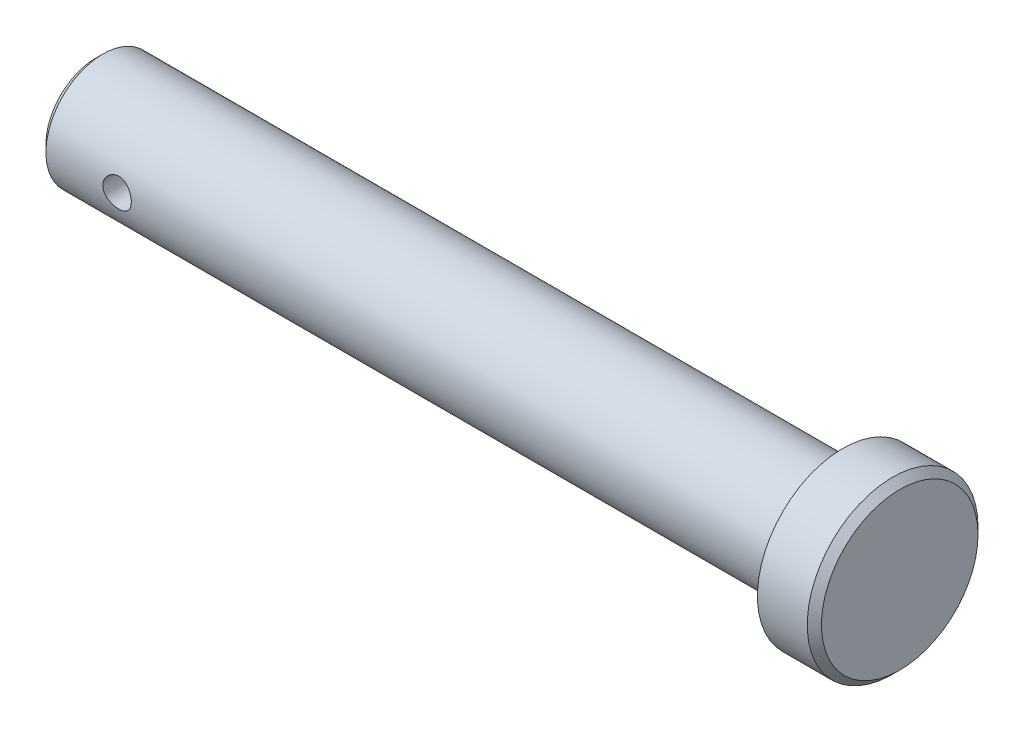
ISO-10303-21;
HEADER;
FILE_DESCRIPTION(('STEP AP214'),'2;1');
FILE_NAME('part.step','',(''),(''),'','','');
FILE_SCHEMA(('AUTOMOTIVE_DESIGN { 1 0 10303 214 1 1 1 1 }'));
ENDSEC;
DATA;
#1=APPLICATION_CONTEXT('core data for automotive mechanical design processes');
#2=APPLICATION_PROTOCOL_DEFINITION('international standard','automotive_design',2000,#1);
#3=PRODUCT_CONTEXT('',#1,'mechanical');
#4=PRODUCT('Part','Part','',(#3));
#5=PRODUCT_RELATED_PRODUCT_CATEGORY('part','',(#4));
#6=PRODUCT_DEFINITION_FORMATION('','',#4);
#7=PRODUCT_DEFINITION_CONTEXT('part definition',#1,'design');
#8=PRODUCT_DEFINITION('design','',#6,#7);
#9=PRODUCT_DEFINITION_SHAPE('','',#8);
#10=(LENGTH_UNIT() NAMED_UNIT(*) SI_UNIT(.MILLI.,.METRE.));
#11=(NAMED_UNIT(*) PLANE_ANGLE_UNIT() SI_UNIT($,.RADIAN.));
#12=(NAMED_UNIT(*) SI_UNIT($,.STERADIAN.) SOLID_ANGLE_UNIT());
#13=UNCERTAINTY_MEASURE_WITH_UNIT(LENGTH_MEASURE(1.E-05),#10,'distance_accuracy_value','');
#14=(GEOMETRIC_REPRESENTATION_CONTEXT(3) GLOBAL_UNCERTAINTY_ASSIGNED_CONTEXT((#13)) GLOBAL_UNIT_ASSIGNED_CONTEXT((#10,
#11,#12)) REPRESENTATION_CONTEXT('',''));
#15=CARTESIAN_POINT('',(0.,0.,0.));
#16=DIRECTION('',(0.,0.,1.));
#17=DIRECTION('',(1.,0.,0.));
#18=AXIS2_PLACEMENT_3D('',#15,#16,#17);
#19=CARTESIAN_POINT('',(-105.,0.,0.));
#20=DIRECTION('',(1.,0.,0.));
#21=DIRECTION('',(0.,0.,-1.));
#22=AXIS2_PLACEMENT_3D('',#19,#20,#21);
#23=CYLINDRICAL_SURFACE('',#22,8.);
#24=CARTESIAN_POINT('',(-96.,0.,8.));
#25=CARTESIAN_POINT('',(-95.9999968990158,0.110501451559641,7.9999981315735));
#26=CARTESIAN_POINT('',(-95.990811265635,0.22103754377435,7.99768770842435));
#27=CARTESIAN_POINT('',(-95.954366464924,0.438941765027376,7.98869485106526));
#28=CARTESIAN_POINT('',(-95.9270970539495,0.546308062494318,7.98200993893301));
#29=CARTESIAN_POINT('',(-95.8554143287172,0.754694496243434,7.96500835109376));
#30=CARTESIAN_POINT('',(-95.811021601713,0.855722084573335,7.95469603789411));
#31=CARTESIAN_POINT('',(-95.7064248132735,1.04889617587257,7.93153791743495));
#32=CARTESIAN_POINT('',(-95.646220218508,1.14104237913168,7.91869202472208));
#33=CARTESIAN_POINT('',(-95.5103989471278,1.31573590306788,7.89156551455591));
#34=CARTESIAN_POINT('',(-95.4345179000546,1.39807425341474,7.87726276197502));
#35=CARTESIAN_POINT('',(-95.270063726788,1.54899856960442,7.84898160157249));
#36=CARTESIAN_POINT('',(-95.1814891694041,1.61758298259892,7.83500323053157));
#37=CARTESIAN_POINT('',(-94.992539697684,1.74003539039863,7.80873034264225));
#38=CARTESIAN_POINT('',(-94.8920090255884,1.79366962123351,7.79646392619748));
#39=CARTESIAN_POINT('',(-94.6830021177866,1.88319587806765,7.77532659757355));
#40=CARTESIAN_POINT('',(-94.5745271555573,1.91909074058685,7.76645514259225));
#41=CARTESIAN_POINT('',(-94.3550086690644,1.97140644907302,7.7533396892843));
#42=CARTESIAN_POINT('',(-94.244060138616,1.98820302444273,7.74900654662681));
#43=CARTESIAN_POINT('',(-94.0208419080009,2.00301570008854,7.74519149946122));
#44=CARTESIAN_POINT('',(-93.9085724257438,2.00103485575748,7.74570880570571));
#45=CARTESIAN_POINT('',(-93.6887789230062,1.9786486995196,7.75145607355756));
#46=CARTESIAN_POINT('',(-93.5812058380462,1.95869112025417,7.75657150676392));
#47=CARTESIAN_POINT('',(-93.3709852654519,1.90163224920398,7.77075612894759));
#48=CARTESIAN_POINT('',(-93.2683381292948,1.86452973609252,7.77982559958985));
#49=CARTESIAN_POINT('',(-93.0696826449972,1.77385263724957,7.80100151874212));
#50=CARTESIAN_POINT('',(-92.9737517709472,1.72011555631055,7.81313769959755));
#51=CARTESIAN_POINT('',(-92.7921083869909,1.59780836801992,7.83906281127988));
#52=CARTESIAN_POINT('',(-92.7063976692437,1.52923566507844,7.85285203112837));
#53=CARTESIAN_POINT('',(-92.5450618457408,1.37688456624162,7.88101174053189));
#54=CARTESIAN_POINT('',(-92.4697940132515,1.29272834422114,7.89538759304001));
#55=CARTESIAN_POINT('',(-92.3343716767148,1.11281589000493,7.92274620771675));
#56=CARTESIAN_POINT('',(-92.2742176343152,1.01705930361059,7.93572892732543));
#57=CARTESIAN_POINT('',(-92.1705992183675,0.816154518241855,7.95890309458921));
#58=CARTESIAN_POINT('',(-92.1271928796608,0.710975190944831,7.96908480170303));
#59=CARTESIAN_POINT('',(-92.0587769257206,0.494501344190513,7.98543889321888));
#60=CARTESIAN_POINT('',(-92.0337637914425,0.383207998867318,7.99161204452374));
#61=CARTESIAN_POINT('',(-92.0033899125882,0.160719960520042,7.999139990285));
#62=CARTESIAN_POINT('',(-91.9975426318996,0.049595626650952,8.00061404677705));
#63=CARTESIAN_POINT('',(-92.0043320027407,-0.172043833068673,7.99891739752601));
#64=CARTESIAN_POINT('',(-92.0169669903989,-0.282559012859456,7.99574710989128));
#65=CARTESIAN_POINT('',(-92.0599612111885,-0.498152358368652,7.98519441503143));
#66=CARTESIAN_POINT('',(-92.0900550179693,-0.603286825291669,7.97787512247748));
#67=CARTESIAN_POINT('',(-92.1668094453713,-0.807009723270011,7.95984942178845));
#68=CARTESIAN_POINT('',(-92.2134717390842,-0.905597492043508,7.94914267159856));
#69=CARTESIAN_POINT('',(-92.3229815051663,-1.09536417923979,7.92524410568414));
#70=CARTESIAN_POINT('',(-92.3861014831957,-1.18638058911443,7.91201156489243));
#71=CARTESIAN_POINT('',(-92.5263865450626,-1.35670215152432,7.88459345583226));
#72=CARTESIAN_POINT('',(-92.6035540528225,-1.43600527863067,7.87040772335606));
#73=CARTESIAN_POINT('',(-92.7720026144593,-1.58265409076364,7.84225275947695));
#74=CARTESIAN_POINT('',(-92.8635836040032,-1.6496584901627,7.82829738916375));
#75=CARTESIAN_POINT('',(-93.0569768459543,-1.76734767868359,7.80257171169652));
#76=CARTESIAN_POINT('',(-93.1587886439463,-1.81803319221058,7.79080130756035));
#77=CARTESIAN_POINT('',(-93.3692076298841,-1.90126856081239,7.77090792979553));
#78=CARTESIAN_POINT('',(-93.4777701711254,-1.93392586220542,7.76276340389208));
#79=CARTESIAN_POINT('',(-93.6990795171855,-1.98046087993837,7.75102325453578));
#80=CARTESIAN_POINT('',(-93.8118254013767,-1.99434270330487,7.74742663626582));
#81=CARTESIAN_POINT('',(-94.0348280318069,-2.00271812044532,7.74526534938609));
#82=CARTESIAN_POINT('',(-94.145063246833,-1.99775719704016,7.74655910304351));
#83=CARTESIAN_POINT('',(-94.3630718515573,-1.96983637108382,7.7537054534379));
#84=CARTESIAN_POINT('',(-94.4708452906848,-1.94687683024902,7.75955795855809));
#85=CARTESIAN_POINT('',(-94.6802779454205,-1.88390842592372,7.77508347576963));
#86=CARTESIAN_POINT('',(-94.7819697403203,-1.84400187290717,7.78473353648412));
#87=CARTESIAN_POINT('',(-94.9772871769516,-1.7483532181401,7.80677007633105));
#88=CARTESIAN_POINT('',(-95.0709116975825,-1.69260892004559,7.81915693494364));
#89=CARTESIAN_POINT('',(-95.2500728386694,-1.56515699818285,7.84567512351349));
#90=CARTESIAN_POINT('',(-95.3353347645653,-1.49307088388301,7.85984353109009));
#91=CARTESIAN_POINT('',(-95.4927293930605,-1.33571916158631,7.88810702995048));
#92=CARTESIAN_POINT('',(-95.564858973484,-1.25045042834819,7.90220210302746));
#93=CARTESIAN_POINT('',(-95.6952150780862,-1.06729011560345,7.92903540863551));
#94=CARTESIAN_POINT('',(-95.7531661515621,-0.969197896421844,7.94174444487824));
#95=CARTESIAN_POINT('',(-95.8516632839207,-0.764354746013966,7.96406566633491));
#96=CARTESIAN_POINT('',(-95.8922218141981,-0.657610084582318,7.97368006933042));
#97=CARTESIAN_POINT('',(-95.9487624404395,-0.459213670991294,7.98730746087389));
#98=CARTESIAN_POINT('',(-95.9679349907379,-0.36850689454409,7.9920344673692));
#99=CARTESIAN_POINT('',(-95.9935545914959,-0.18520809538171,7.99838140309264));
#100=CARTESIAN_POINT('',(-96.0000025990737,-0.0926162149901548,8.00000156601192));
#101=CARTESIAN_POINT('',(-96.,0.,8.));
#102=B_SPLINE_CURVE_WITH_KNOTS('',3,(#24,#25,#26,#27,#28,#29,#30,#31,#32,#33,#34,#35,#36,#37,
#38,#39,#40,#41,#42,#43,#44,#45,#46,#47,#48,#49,#50,#51,#52,#53,#54,#55,#56,#57,#58,#59,#60,#61,
#62,#63,#64,#65,#66,#67,#68,#69,#70,#71,#72,#73,#74,#75,#76,#77,#78,#79,#80,#81,#82,#83,#84,#85,
#86,#87,#88,#89,#90,#91,#92,#93,#94,#95,#96,#97,#98,#99,#100,#101),.UNSPECIFIED.,.T.,.F.,(4,2,2,
2,2,2,2,2,2,2,2,2,2,2,2,2,2,2,2,2,2,2,2,2,2,2,2,2,2,2,2,2,2,2,2,2,2,2,4),(0.,0.331164949962519,
0.662517650351865,0.993473203048145,1.32443992022576,1.66152580582852,1.99864972773415,
2.34078196727741,2.68285948225824,3.01808393468094,3.3532538415469,3.68029996013785,
4.00736937959145,4.337740371696,4.66816921119311,5.00802001296453,5.34788119415423,
5.68890972016578,6.0298729825595,6.36211078603461,6.6943186815475,7.02160366023142,
7.3489216976748,7.68204783424895,8.01523150681784,8.35659345610394,8.69794025003769,
9.03723006156475,9.37644564340969,9.70591707202574,10.035381879458,10.3628853408369,
10.6904342418696,11.0265276855097,11.3627009303165,11.7049624733721,12.0469781843289,
12.3245632392729,12.6021274139514),.UNSPECIFIED.);
#103=CARTESIAN_POINT('',(-96.,0.,8.));
#104=VERTEX_POINT('',#103);
#105=EDGE_CURVE('E65',#104,#104,#102,.T.);
#106=ORIENTED_EDGE('',*,*,#105,.T.);
#107=EDGE_LOOP('',(#106));
#108=FACE_BOUND('',#107,.T.);
#109=CARTESIAN_POINT('',(-104.,0.,0.));
#110=DIRECTION('',(1.,0.,0.));
#111=DIRECTION('',(0.,0.,-1.));
#112=AXIS2_PLACEMENT_3D('',#109,#110,#111);
#113=CIRCLE('',#112,8.);
#114=CARTESIAN_POINT('',(-104.,0.,-8.));
#115=VERTEX_POINT('',#114);
#116=EDGE_CURVE('E101',#115,#115,#113,.T.);
#117=ORIENTED_EDGE('',*,*,#116,.T.);
#118=EDGE_LOOP('',(#117));
#119=FACE_BOUND('',#118,.T.);
#120=CARTESIAN_POINT('',(0.,0.,0.));
#121=DIRECTION('',(1.,0.,0.));
#122=DIRECTION('',(0.,0.,-1.));
#123=AXIS2_PLACEMENT_3D('',#120,#121,#122);
#124=CIRCLE('',#123,8.);
#125=CARTESIAN_POINT('',(0.,0.,-8.));
#126=VERTEX_POINT('',#125);
#127=EDGE_CURVE('E104',#126,#126,#124,.T.);
#128=ORIENTED_EDGE('',*,*,#127,.F.);
#129=EDGE_LOOP('',(#128));
#130=FACE_BOUND('',#129,.T.);
#131=CARTESIAN_POINT('',(-96.,0.,-8.));
#132=CARTESIAN_POINT('',(-95.9999968990158,-0.110501451559641,-7.9999981315735));
#133=CARTESIAN_POINT('',(-95.990811265635,-0.22103754377435,-7.99768770842435));
#134=CARTESIAN_POINT('',(-95.954366464924,-0.438941765027376,-7.98869485106526));
#135=CARTESIAN_POINT('',(-95.9270970539495,-0.546308062494318,-7.98200993893301));
#136=CARTESIAN_POINT('',(-95.8554143287172,-0.754694496243434,-7.96500835109376));
#137=CARTESIAN_POINT('',(-95.811021601713,-0.855722084573335,-7.95469603789411));
#138=CARTESIAN_POINT('',(-95.7064248132735,-1.04889617587257,-7.93153791743495));
#139=CARTESIAN_POINT('',(-95.646220218508,-1.14104237913168,-7.91869202472208));
#140=CARTESIAN_POINT('',(-95.5103989471278,-1.31573590306788,-7.89156551455591));
#141=CARTESIAN_POINT('',(-95.4345179000546,-1.39807425341474,-7.87726276197502));
#142=CARTESIAN_POINT('',(-95.270063726788,-1.54899856960442,-7.84898160157249));
#143=CARTESIAN_POINT('',(-95.1814891694041,-1.61758298259892,-7.83500323053157));
#144=CARTESIAN_POINT('',(-94.992539697684,-1.74003539039863,-7.80873034264225));
#145=CARTESIAN_POINT('',(-94.8920090255884,-1.79366962123351,-7.79646392619748));
#146=CARTESIAN_POINT('',(-94.6830021177866,-1.88319587806765,-7.77532659757355));
#147=CARTESIAN_POINT('',(-94.5745271555573,-1.91909074058685,-7.76645514259225));
#148=CARTESIAN_POINT('',(-94.3550086690644,-1.97140644907302,-7.7533396892843));
#149=CARTESIAN_POINT('',(-94.244060138616,-1.98820302444273,-7.74900654662681));
#150=CARTESIAN_POINT('',(-94.0208419080009,-2.00301570008854,-7.74519149946122));
#151=CARTESIAN_POINT('',(-93.9085724257438,-2.00103485575748,-7.74570880570571));
#152=CARTESIAN_POINT('',(-93.6887789230062,-1.9786486995196,-7.75145607355756));
#153=CARTESIAN_POINT('',(-93.5812058380462,-1.95869112025417,-7.75657150676392));
#154=CARTESIAN_POINT('',(-93.3709852654519,-1.90163224920398,-7.77075612894759));
#155=CARTESIAN_POINT('',(-93.2683381292948,-1.86452973609252,-7.77982559958985));
#156=CARTESIAN_POINT('',(-93.0696826449972,-1.77385263724957,-7.80100151874212));
#157=CARTESIAN_POINT('',(-92.9737517709472,-1.72011555631055,-7.81313769959755));
#158=CARTESIAN_POINT('',(-92.7921083869909,-1.59780836801992,-7.83906281127988));
#159=CARTESIAN_POINT('',(-92.7063976692437,-1.52923566507844,-7.85285203112837));
#160=CARTESIAN_POINT('',(-92.5450618457408,-1.37688456624162,-7.88101174053189));
#161=CARTESIAN_POINT('',(-92.4697940132515,-1.29272834422114,-7.89538759304001));
#162=CARTESIAN_POINT('',(-92.3343716767148,-1.11281589000493,-7.92274620771675));
#163=CARTESIAN_POINT('',(-92.2742176343152,-1.01705930361059,-7.93572892732543));
#164=CARTESIAN_POINT('',(-92.1705992183675,-0.816154518241855,-7.95890309458921));
#165=CARTESIAN_POINT('',(-92.1271928796608,-0.710975190944831,-7.96908480170303));
#166=CARTESIAN_POINT('',(-92.0587769257206,-0.494501344190513,-7.98543889321888));
#167=CARTESIAN_POINT('',(-92.0337637914425,-0.383207998867318,-7.99161204452374));
#168=CARTESIAN_POINT('',(-92.0033899125882,-0.160719960520042,-7.999139990285));
#169=CARTESIAN_POINT('',(-91.9975426318996,-0.049595626650952,-8.00061404677705));
#170=CARTESIAN_POINT('',(-92.0043320027407,0.172043833068673,-7.99891739752601));
#171=CARTESIAN_POINT('',(-92.0169669903989,0.282559012859456,-7.99574710989128));
#172=CARTESIAN_POINT('',(-92.0599612111885,0.498152358368652,-7.98519441503143));
#173=CARTESIAN_POINT('',(-92.0900550179693,0.603286825291669,-7.97787512247748));
#174=CARTESIAN_POINT('',(-92.1668094453713,0.807009723270011,-7.95984942178845));
#175=CARTESIAN_POINT('',(-92.2134717390842,0.905597492043508,-7.94914267159856));
#176=CARTESIAN_POINT('',(-92.3229815051663,1.09536417923979,-7.92524410568414));
#177=CARTESIAN_POINT('',(-92.3861014831957,1.18638058911443,-7.91201156489243));
#178=CARTESIAN_POINT('',(-92.5263865450626,1.35670215152432,-7.88459345583226));
#179=CARTESIAN_POINT('',(-92.6035540528225,1.43600527863067,-7.87040772335606));
#180=CARTESIAN_POINT('',(-92.7720026144593,1.58265409076364,-7.84225275947695));
#181=CARTESIAN_POINT('',(-92.8635836040032,1.6496584901627,-7.82829738916375));
#182=CARTESIAN_POINT('',(-93.0569768459543,1.76734767868359,-7.80257171169652));
#183=CARTESIAN_POINT('',(-93.1587886439463,1.81803319221058,-7.79080130756035));
#184=CARTESIAN_POINT('',(-93.3692076298841,1.90126856081239,-7.77090792979553));
#185=CARTESIAN_POINT('',(-93.4777701711254,1.93392586220542,-7.76276340389208));
#186=CARTESIAN_POINT('',(-93.6990795171855,1.98046087993837,-7.75102325453578));
#187=CARTESIAN_POINT('',(-93.8118254013767,1.99434270330487,-7.74742663626582));
#188=CARTESIAN_POINT('',(-94.0348280318069,2.00271812044532,-7.74526534938609));
#189=CARTESIAN_POINT('',(-94.145063246833,1.99775719704016,-7.74655910304351));
#190=CARTESIAN_POINT('',(-94.3630718515573,1.96983637108382,-7.7537054534379));
#191=CARTESIAN_POINT('',(-94.4708452906848,1.94687683024902,-7.75955795855809));
#192=CARTESIAN_POINT('',(-94.6802779454205,1.88390842592372,-7.77508347576963));
#193=CARTESIAN_POINT('',(-94.7819697403203,1.84400187290717,-7.78473353648412));
#194=CARTESIAN_POINT('',(-94.9772871769516,1.7483532181401,-7.80677007633105));
#195=CARTESIAN_POINT('',(-95.0709116975825,1.69260892004559,-7.81915693494364));
#196=CARTESIAN_POINT('',(-95.2500728386694,1.56515699818285,-7.84567512351349));
#197=CARTESIAN_POINT('',(-95.3353347645653,1.49307088388301,-7.85984353109009));
#198=CARTESIAN_POINT('',(-95.4927293930605,1.33571916158631,-7.88810702995048));
#199=CARTESIAN_POINT('',(-95.564858973484,1.25045042834819,-7.90220210302746));
#200=CARTESIAN_POINT('',(-95.6952150780862,1.06729011560345,-7.92903540863551));
#201=CARTESIAN_POINT('',(-95.7531661515621,0.969197896421844,-7.94174444487824));
#202=CARTESIAN_POINT('',(-95.8516632839207,0.764354746013966,-7.96406566633491));
#203=CARTESIAN_POINT('',(-95.8922218141981,0.657610084582318,-7.97368006933042));
#204=CARTESIAN_POINT('',(-95.9487624404395,0.459213670991294,-7.98730746087389));
#205=CARTESIAN_POINT('',(-95.9679349907379,0.36850689454409,-7.9920344673692));
#206=CARTESIAN_POINT('',(-95.9935545914959,0.18520809538171,-7.99838140309264));
#207=CARTESIAN_POINT('',(-96.0000025990737,0.0926162149901548,-8.00000156601192));
#208=CARTESIAN_POINT('',(-96.,0.,-8.));
#209=B_SPLINE_CURVE_WITH_KNOTS('',3,(#131,#132,#133,#134,#135,#136,#137,#138,#139,#140,#141,
#142,#143,#144,#145,#146,#147,#148,#149,#150,#151,#152,#153,#154,#155,#156,#157,#158,#159,#160,
#161,#162,#163,#164,#165,#166,#167,#168,#169,#170,#171,#172,#173,#174,#175,#176,#177,#178,#179,
#180,#181,#182,#183,#184,#185,#186,#187,#188,#189,#190,#191,#192,#193,#194,#195,#196,#197,#198,
#199,#200,#201,#202,#203,#204,#205,#206,#207,#208),.UNSPECIFIED.,.T.,.F.,(4,2,2,2,2,2,2,2,2,2,2,
2,2,2,2,2,2,2,2,2,2,2,2,2,2,2,2,2,2,2,2,2,2,2,2,2,2,2,4),(0.,0.331164949962519,
0.662517650351865,0.993473203048145,1.32443992022576,1.66152580582852,1.99864972773415,
2.34078196727741,2.68285948225824,3.01808393468094,3.3532538415469,3.68029996013785,
4.00736937959145,4.337740371696,4.66816921119311,5.00802001296453,5.34788119415423,
5.68890972016578,6.0298729825595,6.36211078603461,6.6943186815475,7.02160366023142,
7.3489216976748,7.68204783424895,8.01523150681784,8.35659345610394,8.69794025003769,
9.03723006156475,9.37644564340969,9.70591707202574,10.035381879458,10.3628853408369,
10.6904342418696,11.0265276855097,11.3627009303165,11.7049624733721,12.0469781843289,
12.3245632392729,12.6021274139514),.UNSPECIFIED.);
#210=CARTESIAN_POINT('',(-96.,0.,-8.));
#211=VERTEX_POINT('',#210);
#212=EDGE_CURVE('E46',#211,#211,#209,.T.);
#213=ORIENTED_EDGE('',*,*,#212,.T.);
#214=EDGE_LOOP('',(#213));
#215=FACE_BOUND('',#214,.T.);
#216=ADVANCED_FACE('F41',(#108,#119,#130,#215),#23,.T.);
#217=CARTESIAN_POINT('',(-105.,0.,0.));
#218=DIRECTION('',(1.,0.,0.));
#219=DIRECTION('',(0.,0.,-1.));
#220=AXIS2_PLACEMENT_3D('',#217,#218,#219);
#221=PLANE('',#220);
#222=CARTESIAN_POINT('',(-105.,0.,0.));
#223=DIRECTION('',(1.,0.,0.));
#224=DIRECTION('',(0.,0.,-1.));
#225=AXIS2_PLACEMENT_3D('',#222,#223,#224);
#226=CIRCLE('',#225,7.00000000000001);
#227=CARTESIAN_POINT('',(-105.,0.,-7.00000000000001));
#228=VERTEX_POINT('',#227);
#229=EDGE_CURVE('E62',#228,#228,#226,.F.);
#230=ORIENTED_EDGE('',*,*,#229,.T.);
#231=EDGE_LOOP('',(#230));
#232=FACE_BOUND('',#231,.T.);
#233=ADVANCED_FACE('F90',(#232),#221,.F.);
#234=CARTESIAN_POINT('',(8.,0.,0.));
#235=DIRECTION('',(-1.,0.,0.));
#236=DIRECTION('',(0.,0.,1.));
#237=AXIS2_PLACEMENT_3D('',#234,#235,#236);
#238=CYLINDRICAL_SURFACE('',#237,12.);
#239=CARTESIAN_POINT('',(7.00000000000001,0.,0.));
#240=DIRECTION('',(1.,0.,0.));
#241=DIRECTION('',(0.,0.,-1.));
#242=AXIS2_PLACEMENT_3D('',#239,#240,#241);
#243=CIRCLE('',#242,12.);
#244=CARTESIAN_POINT('',(7.00000000000001,0.,-12.));
#245=VERTEX_POINT('',#244);
#246=EDGE_CURVE('E10',#245,#245,#243,.F.);
#247=ORIENTED_EDGE('',*,*,#246,.T.);
#248=EDGE_LOOP('',(#247));
#249=FACE_BOUND('',#248,.T.);
#250=CARTESIAN_POINT('',(0.,0.,0.));
#251=DIRECTION('',(1.,0.,0.));
#252=DIRECTION('',(0.,0.,-1.));
#253=AXIS2_PLACEMENT_3D('',#250,#251,#252);
#254=CIRCLE('',#253,12.);
#255=CARTESIAN_POINT('',(0.,0.,-12.));
#256=VERTEX_POINT('',#255);
#257=EDGE_CURVE('E110',#256,#256,#254,.T.);
#258=ORIENTED_EDGE('',*,*,#257,.T.);
#259=EDGE_LOOP('',(#258));
#260=FACE_BOUND('',#259,.T.);
#261=ADVANCED_FACE('F83',(#249,#260),#238,.T.);
#262=CARTESIAN_POINT('',(8.,0.,0.));
#263=DIRECTION('',(1.,0.,0.));
#264=DIRECTION('',(0.,0.,-1.));
#265=AXIS2_PLACEMENT_3D('',#262,#263,#264);
#266=PLANE('',#265);
#267=CARTESIAN_POINT('',(8.,0.,0.));
#268=DIRECTION('',(1.,0.,0.));
#269=DIRECTION('',(0.,0.,-1.));
#270=AXIS2_PLACEMENT_3D('',#267,#268,#269);
#271=CIRCLE('',#270,11.);
#272=CARTESIAN_POINT('',(8.,0.,-11.));
#273=VERTEX_POINT('',#272);
#274=EDGE_CURVE('E56',#273,#273,#271,.T.);
#275=ORIENTED_EDGE('',*,*,#274,.T.);
#276=EDGE_LOOP('',(#275));
#277=FACE_BOUND('',#276,.T.);
#278=ADVANCED_FACE('F78',(#277),#266,.T.);
#279=CARTESIAN_POINT('',(0.,0.,0.));
#280=DIRECTION('',(1.,0.,0.));
#281=DIRECTION('',(0.,0.,-1.));
#282=AXIS2_PLACEMENT_3D('',#279,#280,#281);
#283=PLANE('',#282);
#284=ORIENTED_EDGE('',*,*,#127,.T.);
#285=EDGE_LOOP('',(#284));
#286=FACE_BOUND('',#285,.T.);
#287=ORIENTED_EDGE('',*,*,#257,.F.);
#288=EDGE_LOOP('',(#287));
#289=FACE_BOUND('',#288,.T.);
#290=ADVANCED_FACE('F82',(#286,#289),#283,.F.);
#291=CARTESIAN_POINT('',(-104.,0.,0.));
#292=DIRECTION('',(1.,0.,0.));
#293=DIRECTION('',(0.,0.,-1.));
#294=AXIS2_PLACEMENT_3D('',#291,#292,#293);
#295=CONICAL_SURFACE('',#294,8.,0.785398163397438);
#296=ORIENTED_EDGE('',*,*,#229,.F.);
#297=EDGE_LOOP('',(#296));
#298=FACE_BOUND('',#297,.T.);
#299=ORIENTED_EDGE('',*,*,#116,.F.);
#300=EDGE_LOOP('',(#299));
#301=FACE_BOUND('',#300,.T.);
#302=ADVANCED_FACE('F87',(#298,#301),#295,.T.);
#303=CARTESIAN_POINT('',(8.,0.,0.));
#304=DIRECTION('',(-1.,0.,0.));
#305=DIRECTION('',(0.,0.,1.));
#306=AXIS2_PLACEMENT_3D('',#303,#304,#305);
#307=CONICAL_SURFACE('',#306,11.,0.785398163397447);
#308=ORIENTED_EDGE('',*,*,#246,.F.);
#309=EDGE_LOOP('',(#308));
#310=FACE_BOUND('',#309,.T.);
#311=ORIENTED_EDGE('',*,*,#274,.F.);
#312=EDGE_LOOP('',(#311));
#313=FACE_BOUND('',#312,.T.);
#314=ADVANCED_FACE('F44',(#310,#313),#307,.T.);
#315=CARTESIAN_POINT('',(-94.,0.,14.));
#316=DIRECTION('',(0.,0.,-1.));
#317=DIRECTION('',(-1.,0.,0.));
#318=AXIS2_PLACEMENT_3D('',#315,#316,#317);
#319=CYLINDRICAL_SURFACE('',#318,2.);
#320=ORIENTED_EDGE('',*,*,#212,.F.);
#321=EDGE_LOOP('',(#320));
#322=FACE_BOUND('',#321,.T.);
#323=ORIENTED_EDGE('',*,*,#105,.F.);
#324=EDGE_LOOP('',(#323));
#325=FACE_BOUND('',#324,.T.);
#326=ADVANCED_FACE('F73',(#322,#325),#319,.F.);
#327=CLOSED_SHELL('',(#216,#233,#261,#278,#290,#302,#314,#326));
#328=MANIFOLD_SOLID_BREP('B2',#327);
#329=ADVANCED_BREP_SHAPE_REPRESENTATION('',(#18,#328),#14);
#330=SHAPE_DEFINITION_REPRESENTATION(#9,#329);
ENDSEC;
END-ISO-10303-21;
